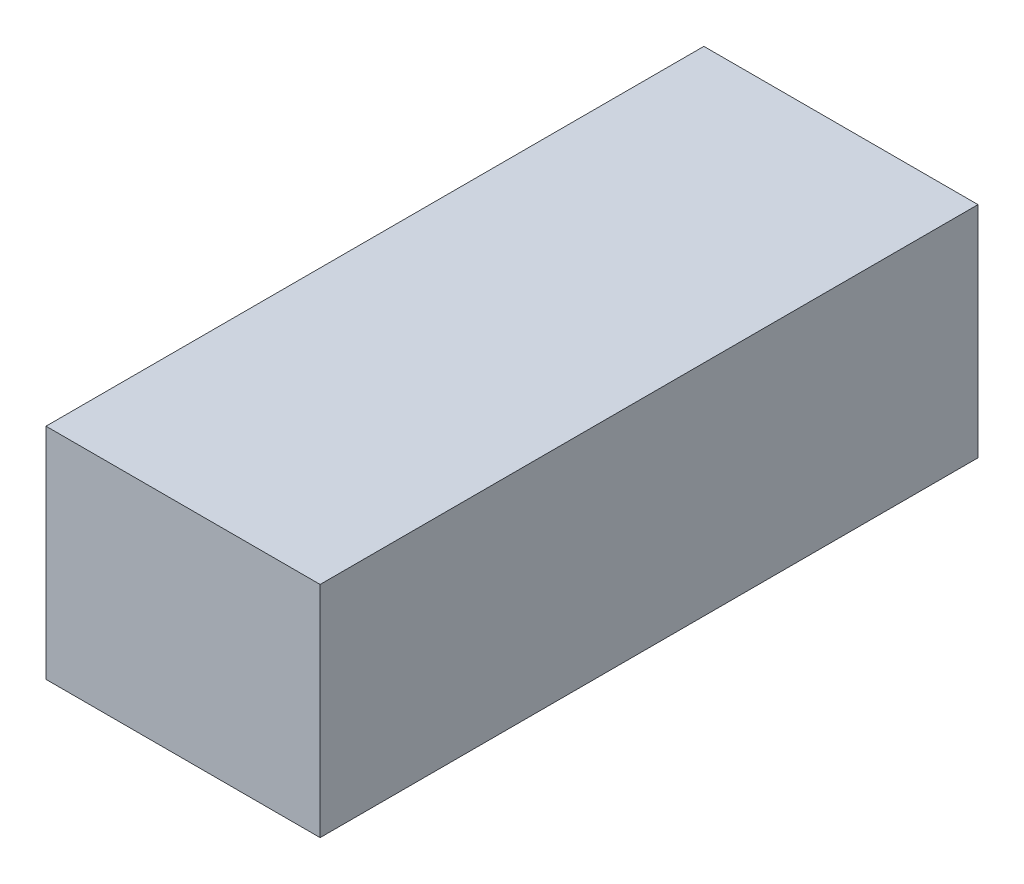
ISO-10303-21;
HEADER;
FILE_DESCRIPTION(('STEP AP214'),'2;1');
FILE_NAME('part.step','',(''),(''),'','','');
FILE_SCHEMA(('AUTOMOTIVE_DESIGN { 1 0 10303 214 1 1 1 1 }'));
ENDSEC;
DATA;
#1=APPLICATION_CONTEXT('core data for automotive mechanical design processes');
#2=APPLICATION_PROTOCOL_DEFINITION('international standard','automotive_design',2000,#1);
#3=PRODUCT_CONTEXT('',#1,'mechanical');
#4=PRODUCT('Part','Part','',(#3));
#5=PRODUCT_RELATED_PRODUCT_CATEGORY('part','',(#4));
#6=PRODUCT_DEFINITION_FORMATION('','',#4);
#7=PRODUCT_DEFINITION_CONTEXT('part definition',#1,'design');
#8=PRODUCT_DEFINITION('design','',#6,#7);
#9=PRODUCT_DEFINITION_SHAPE('','',#8);
#10=(LENGTH_UNIT() NAMED_UNIT(*) SI_UNIT(.MILLI.,.METRE.));
#11=(NAMED_UNIT(*) PLANE_ANGLE_UNIT() SI_UNIT($,.RADIAN.));
#12=(NAMED_UNIT(*) SI_UNIT($,.STERADIAN.) SOLID_ANGLE_UNIT());
#13=UNCERTAINTY_MEASURE_WITH_UNIT(LENGTH_MEASURE(1.E-05),#10,'distance_accuracy_value','');
#14=(GEOMETRIC_REPRESENTATION_CONTEXT(3) GLOBAL_UNCERTAINTY_ASSIGNED_CONTEXT((#13)) GLOBAL_UNIT_ASSIGNED_CONTEXT((#10,
#11,#12)) REPRESENTATION_CONTEXT('',''));
#15=CARTESIAN_POINT('',(0.,0.,0.));
#16=DIRECTION('',(0.,0.,1.));
#17=DIRECTION('',(1.,0.,0.));
#18=AXIS2_PLACEMENT_3D('',#15,#16,#17);
#19=CARTESIAN_POINT('',(12.5,10.,30.));
#20=DIRECTION('',(-1.,0.,0.));
#21=DIRECTION('',(0.,-1.,0.));
#22=AXIS2_PLACEMENT_3D('',#19,#20,#21);
#23=PLANE('',#22);
#24=DIRECTION('',(0.,1.,0.));
#25=VECTOR('',#24,1.);
#26=CARTESIAN_POINT('',(12.5,10.,-30.));
#27=LINE('',#26,#25);
#28=CARTESIAN_POINT('',(12.5,-10.,-30.));
#29=VERTEX_POINT('',#28);
#30=CARTESIAN_POINT('',(12.5,10.,-30.));
#31=VERTEX_POINT('',#30);
#32=EDGE_CURVE('E96',#29,#31,#27,.T.);
#33=ORIENTED_EDGE('',*,*,#32,.T.);
#34=DIRECTION('',(0.,0.,-1.));
#35=VECTOR('',#34,1.);
#36=CARTESIAN_POINT('',(12.5,10.,30.));
#37=LINE('',#36,#35);
#38=CARTESIAN_POINT('',(12.5,10.,30.));
#39=VERTEX_POINT('',#38);
#40=EDGE_CURVE('E11',#39,#31,#37,.T.);
#41=ORIENTED_EDGE('',*,*,#40,.F.);
#42=DIRECTION('',(0.,1.,0.));
#43=VECTOR('',#42,1.);
#44=CARTESIAN_POINT('',(12.5,10.,30.));
#45=LINE('',#44,#43);
#46=CARTESIAN_POINT('',(12.5,-10.,30.));
#47=VERTEX_POINT('',#46);
#48=EDGE_CURVE('E84',#47,#39,#45,.T.);
#49=ORIENTED_EDGE('',*,*,#48,.F.);
#50=DIRECTION('',(0.,0.,-1.));
#51=VECTOR('',#50,1.);
#52=CARTESIAN_POINT('',(12.5,-10.,30.));
#53=LINE('',#52,#51);
#54=EDGE_CURVE('E92',#47,#29,#53,.T.);
#55=ORIENTED_EDGE('',*,*,#54,.T.);
#56=EDGE_LOOP('',(#33,#41,#49,#55));
#57=FACE_BOUND('',#56,.T.);
#58=ADVANCED_FACE('F33',(#57),#23,.F.);
#59=CARTESIAN_POINT('',(-12.5,10.,30.));
#60=DIRECTION('',(0.,-1.,0.));
#61=DIRECTION('',(0.,0.,-1.));
#62=AXIS2_PLACEMENT_3D('',#59,#60,#61);
#63=PLANE('',#62);
#64=DIRECTION('',(-1.,0.,0.));
#65=VECTOR('',#64,1.);
#66=CARTESIAN_POINT('',(-12.5,10.,-30.));
#67=LINE('',#66,#65);
#68=CARTESIAN_POINT('',(-12.5,10.,-30.));
#69=VERTEX_POINT('',#68);
#70=EDGE_CURVE('E88',#31,#69,#67,.T.);
#71=ORIENTED_EDGE('',*,*,#70,.T.);
#72=DIRECTION('',(0.,0.,-1.));
#73=VECTOR('',#72,1.);
#74=CARTESIAN_POINT('',(-12.5,10.,30.));
#75=LINE('',#74,#73);
#76=CARTESIAN_POINT('',(-12.5,10.,30.));
#77=VERTEX_POINT('',#76);
#78=EDGE_CURVE('E41',#77,#69,#75,.T.);
#79=ORIENTED_EDGE('',*,*,#78,.F.);
#80=DIRECTION('',(-1.,0.,0.));
#81=VECTOR('',#80,1.);
#82=CARTESIAN_POINT('',(-12.5,10.,30.));
#83=LINE('',#82,#81);
#84=EDGE_CURVE('E79',#39,#77,#83,.T.);
#85=ORIENTED_EDGE('',*,*,#84,.F.);
#86=ORIENTED_EDGE('',*,*,#40,.T.);
#87=EDGE_LOOP('',(#71,#79,#85,#86));
#88=FACE_BOUND('',#87,.T.);
#89=ADVANCED_FACE('F87',(#88),#63,.F.);
#90=CARTESIAN_POINT('',(-12.5,10.,30.));
#91=DIRECTION('',(1.,0.,0.));
#92=DIRECTION('',(0.,1.,0.));
#93=AXIS2_PLACEMENT_3D('',#90,#91,#92);
#94=PLANE('',#93);
#95=DIRECTION('',(0.,-1.,0.));
#96=VECTOR('',#95,1.);
#97=CARTESIAN_POINT('',(-12.5,10.,-30.));
#98=LINE('',#97,#96);
#99=CARTESIAN_POINT('',(-12.5,-10.,-30.));
#100=VERTEX_POINT('',#99);
#101=EDGE_CURVE('E66',#69,#100,#98,.T.);
#102=ORIENTED_EDGE('',*,*,#101,.T.);
#103=DIRECTION('',(0.,0.,-1.));
#104=VECTOR('',#103,1.);
#105=CARTESIAN_POINT('',(-12.5,-10.,30.));
#106=LINE('',#105,#104);
#107=CARTESIAN_POINT('',(-12.5,-10.,30.));
#108=VERTEX_POINT('',#107);
#109=EDGE_CURVE('E89',#108,#100,#106,.T.);
#110=ORIENTED_EDGE('',*,*,#109,.F.);
#111=DIRECTION('',(0.,-1.,0.));
#112=VECTOR('',#111,1.);
#113=CARTESIAN_POINT('',(-12.5,10.,30.));
#114=LINE('',#113,#112);
#115=EDGE_CURVE('E82',#77,#108,#114,.T.);
#116=ORIENTED_EDGE('',*,*,#115,.F.);
#117=ORIENTED_EDGE('',*,*,#78,.T.);
#118=EDGE_LOOP('',(#102,#110,#116,#117));
#119=FACE_BOUND('',#118,.T.);
#120=ADVANCED_FACE('F90',(#119),#94,.F.);
#121=CARTESIAN_POINT('',(-12.5,-10.,30.));
#122=DIRECTION('',(0.,1.,0.));
#123=DIRECTION('',(0.,0.,1.));
#124=AXIS2_PLACEMENT_3D('',#121,#122,#123);
#125=PLANE('',#124);
#126=DIRECTION('',(1.,0.,0.));
#127=VECTOR('',#126,1.);
#128=CARTESIAN_POINT('',(-12.5,-10.,-30.));
#129=LINE('',#128,#127);
#130=EDGE_CURVE('E72',#100,#29,#129,.T.);
#131=ORIENTED_EDGE('',*,*,#130,.T.);
#132=ORIENTED_EDGE('',*,*,#54,.F.);
#133=DIRECTION('',(1.,0.,0.));
#134=VECTOR('',#133,1.);
#135=CARTESIAN_POINT('',(-12.5,-10.,30.));
#136=LINE('',#135,#134);
#137=EDGE_CURVE('E49',#108,#47,#136,.T.);
#138=ORIENTED_EDGE('',*,*,#137,.F.);
#139=ORIENTED_EDGE('',*,*,#109,.T.);
#140=EDGE_LOOP('',(#131,#132,#138,#139));
#141=FACE_BOUND('',#140,.T.);
#142=ADVANCED_FACE('F103',(#141),#125,.F.);
#143=CARTESIAN_POINT('',(0.,0.,30.));
#144=DIRECTION('',(0.,0.,1.));
#145=DIRECTION('',(1.,0.,0.));
#146=AXIS2_PLACEMENT_3D('',#143,#144,#145);
#147=PLANE('',#146);
#148=ORIENTED_EDGE('',*,*,#48,.T.);
#149=ORIENTED_EDGE('',*,*,#84,.T.);
#150=ORIENTED_EDGE('',*,*,#115,.T.);
#151=ORIENTED_EDGE('',*,*,#137,.T.);
#152=EDGE_LOOP('',(#148,#149,#150,#151));
#153=FACE_BOUND('',#152,.T.);
#154=ADVANCED_FACE('F80',(#153),#147,.T.);
#155=CARTESIAN_POINT('',(0.,0.,-30.));
#156=DIRECTION('',(0.,0.,1.));
#157=DIRECTION('',(1.,0.,0.));
#158=AXIS2_PLACEMENT_3D('',#155,#156,#157);
#159=PLANE('',#158);
#160=ORIENTED_EDGE('',*,*,#32,.F.);
#161=ORIENTED_EDGE('',*,*,#130,.F.);
#162=ORIENTED_EDGE('',*,*,#101,.F.);
#163=ORIENTED_EDGE('',*,*,#70,.F.);
#164=EDGE_LOOP('',(#160,#161,#162,#163));
#165=FACE_BOUND('',#164,.T.);
#166=ADVANCED_FACE('F106',(#165),#159,.F.);
#167=CLOSED_SHELL('',(#58,#89,#120,#142,#154,#166));
#168=MANIFOLD_SOLID_BREP('B2',#167);
#169=ADVANCED_BREP_SHAPE_REPRESENTATION('',(#18,#168),#14);
#170=SHAPE_DEFINITION_REPRESENTATION(#9,#169);
ENDSEC;
END-ISO-10303-21;
